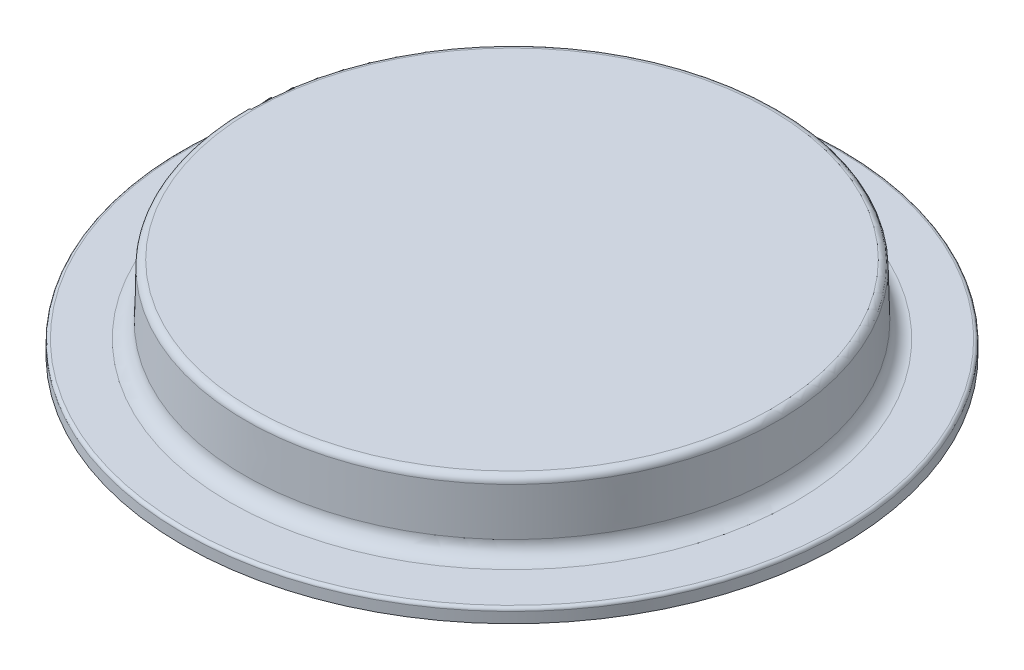
ISO-10303-21;
HEADER;
FILE_DESCRIPTION(('STEP AP214'),'2;1');
FILE_NAME('part.step','',(''),(''),'','','');
FILE_SCHEMA(('AUTOMOTIVE_DESIGN { 1 0 10303 214 1 1 1 1 }'));
ENDSEC;
DATA;
#1=APPLICATION_CONTEXT('core data for automotive mechanical design processes');
#2=APPLICATION_PROTOCOL_DEFINITION('international standard','automotive_design',2000,#1);
#3=PRODUCT_CONTEXT('',#1,'mechanical');
#4=PRODUCT('Part','Part','',(#3));
#5=PRODUCT_RELATED_PRODUCT_CATEGORY('part','',(#4));
#6=PRODUCT_DEFINITION_FORMATION('','',#4);
#7=PRODUCT_DEFINITION_CONTEXT('part definition',#1,'design');
#8=PRODUCT_DEFINITION('design','',#6,#7);
#9=PRODUCT_DEFINITION_SHAPE('','',#8);
#10=(LENGTH_UNIT() NAMED_UNIT(*) SI_UNIT(.MILLI.,.METRE.));
#11=(NAMED_UNIT(*) PLANE_ANGLE_UNIT() SI_UNIT($,.RADIAN.));
#12=(NAMED_UNIT(*) SI_UNIT($,.STERADIAN.) SOLID_ANGLE_UNIT());
#13=UNCERTAINTY_MEASURE_WITH_UNIT(LENGTH_MEASURE(1.E-05),#10,'distance_accuracy_value','');
#14=(GEOMETRIC_REPRESENTATION_CONTEXT(3) GLOBAL_UNCERTAINTY_ASSIGNED_CONTEXT((#13)) GLOBAL_UNIT_ASSIGNED_CONTEXT((#10,
#11,#12)) REPRESENTATION_CONTEXT('',''));
#15=CARTESIAN_POINT('',(0.,0.,0.));
#16=DIRECTION('',(0.,0.,1.));
#17=DIRECTION('',(1.,0.,0.));
#18=AXIS2_PLACEMENT_3D('',#15,#16,#17);
#19=CARTESIAN_POINT('',(0.,-0.793750000000001,6.35));
#20=DIRECTION('',(0.,1.,0.));
#21=DIRECTION('',(0.,0.,1.));
#22=AXIS2_PLACEMENT_3D('',#19,#20,#21);
#23=PLANE('',#22);
#24=CARTESIAN_POINT('',(0.,-0.793749999999999,0.));
#25=DIRECTION('',(0.,-1.,0.));
#26=DIRECTION('',(0.,0.,-1.));
#27=AXIS2_PLACEMENT_3D('',#24,#25,#26);
#28=CIRCLE('',#27,6.35);
#29=CARTESIAN_POINT('',(0.,-0.793749999999998,-6.35));
#30=VERTEX_POINT('',#29);
#31=EDGE_CURVE('E73',#30,#30,#28,.T.);
#32=ORIENTED_EDGE('',*,*,#31,.T.);
#33=EDGE_LOOP('',(#32));
#34=FACE_BOUND('',#33,.T.);
#35=ADVANCED_FACE('F47',(#34),#23,.F.);
#36=CARTESIAN_POINT('',(0.,0.793749999999999,4.9911));
#37=DIRECTION('',(0.,-1.,0.));
#38=DIRECTION('',(0.,0.,-1.));
#39=AXIS2_PLACEMENT_3D('',#36,#37,#38);
#40=PLANE('',#39);
#41=CARTESIAN_POINT('',(0.,0.79375,0.));
#42=DIRECTION('',(0.,-1.,0.));
#43=DIRECTION('',(0.,0.,-1.));
#44=AXIS2_PLACEMENT_3D('',#41,#42,#43);
#45=CIRCLE('',#44,4.9911);
#46=CARTESIAN_POINT('',(0.,0.793750000000001,-4.9911));
#47=VERTEX_POINT('',#46);
#48=EDGE_CURVE('E67',#47,#47,#45,.T.);
#49=ORIENTED_EDGE('',*,*,#48,.F.);
#50=EDGE_LOOP('',(#49));
#51=FACE_BOUND('',#50,.T.);
#52=ADVANCED_FACE('F91',(#51),#40,.F.);
#53=CARTESIAN_POINT('',(0.,0.660400000000001,0.));
#54=DIRECTION('',(0.,-1.,0.));
#55=DIRECTION('',(0.,0.,-1.));
#56=AXIS2_PLACEMENT_3D('',#53,#54,#55);
#57=TOROIDAL_SURFACE('',#56,4.9911,0.133349999999999);
#58=CARTESIAN_POINT('',(0.,0.663890696056855,0.));
#59=DIRECTION('',(0.,-1.,0.));
#60=DIRECTION('',(0.,0.,-1.));
#61=AXIS2_PLACEMENT_3D('',#58,#59,#60);
#62=CIRCLE('',#61,5.12440430428549);
#63=CARTESIAN_POINT('',(0.,0.663890696056856,-5.12440430428549));
#64=VERTEX_POINT('',#63);
#65=EDGE_CURVE('E70',#64,#64,#62,.T.);
#66=ORIENTED_EDGE('',*,*,#65,.F.);
#67=EDGE_LOOP('',(#66));
#68=FACE_BOUND('',#67,.T.);
#69=ORIENTED_EDGE('',*,*,#48,.T.);
#70=EDGE_LOOP('',(#69));
#71=FACE_BOUND('',#70,.T.);
#72=ADVANCED_FACE('F96',(#68,#71),#57,.T.);
#73=CARTESIAN_POINT('',(0.,0.663890696056855,0.));
#74=DIRECTION('',(0.,-1.,0.));
#75=DIRECTION('',(0.,0.,-1.));
#76=AXIS2_PLACEMENT_3D('',#73,#74,#75);
#77=CONICAL_SURFACE('',#76,5.12440430428549,0.0261799387799085);
#78=CARTESIAN_POINT('',(0.,-0.238394207646745,0.));
#79=DIRECTION('',(0.,-1.,0.));
#80=DIRECTION('',(0.,0.,-1.));
#81=AXIS2_PLACEMENT_3D('',#78,#79,#80);
#82=CIRCLE('',#81,5.14803146600693);
#83=CARTESIAN_POINT('',(0.,-0.238394207646744,-5.14803146600693));
#84=VERTEX_POINT('',#83);
#85=EDGE_CURVE('E58',#84,#84,#82,.F.);
#86=ORIENTED_EDGE('',*,*,#85,.T.);
#87=EDGE_LOOP('',(#86));
#88=FACE_BOUND('',#87,.T.);
#89=ORIENTED_EDGE('',*,*,#65,.T.);
#90=EDGE_LOOP('',(#89));
#91=FACE_BOUND('',#90,.T.);
#92=ADVANCED_FACE('F88',(#88,#91),#77,.T.);
#93=CARTESIAN_POINT('',(0.,-0.529166666666667,6.35));
#94=DIRECTION('',(0.,-1.,0.));
#95=DIRECTION('',(0.,0.,-1.));
#96=AXIS2_PLACEMENT_3D('',#93,#94,#95);
#97=PLANE('',#96);
#98=CARTESIAN_POINT('',(0.,-0.529166666666666,0.));
#99=DIRECTION('',(0.,-1.,0.));
#100=DIRECTION('',(0.,0.,-1.));
#101=AXIS2_PLACEMENT_3D('',#98,#99,#100);
#102=CIRCLE('',#101,6.29028228054066);
#103=CARTESIAN_POINT('',(0.,-0.529166666666665,-6.29028228054066));
#104=VERTEX_POINT('',#103);
#105=EDGE_CURVE('E12',#104,#104,#102,.F.);
#106=ORIENTED_EDGE('',*,*,#105,.T.);
#107=EDGE_LOOP('',(#106));
#108=FACE_BOUND('',#107,.T.);
#109=CARTESIAN_POINT('',(0.,-0.529166666666666,0.));
#110=DIRECTION('',(0.,-1.,0.));
#111=DIRECTION('',(0.,0.,-1.));
#112=AXIS2_PLACEMENT_3D('',#109,#110,#111);
#113=CIRCLE('',#112,5.44651774444872);
#114=CARTESIAN_POINT('',(0.,-0.529166666666665,-5.44651774444872));
#115=VERTEX_POINT('',#114);
#116=EDGE_CURVE('E62',#115,#115,#113,.T.);
#117=ORIENTED_EDGE('',*,*,#116,.T.);
#118=EDGE_LOOP('',(#117));
#119=FACE_BOUND('',#118,.T.);
#120=ADVANCED_FACE('F81',(#108,#119),#97,.F.);
#121=CARTESIAN_POINT('',(0.,-0.79375,0.));
#122=DIRECTION('',(0.,-1.,0.));
#123=DIRECTION('',(0.,0.,-1.));
#124=AXIS2_PLACEMENT_3D('',#121,#122,#123);
#125=CYLINDRICAL_SURFACE('',#124,6.35);
#126=CARTESIAN_POINT('',(0.,-0.588884386126001,0.));
#127=DIRECTION('',(0.,-1.,0.));
#128=DIRECTION('',(0.,0.,-1.));
#129=AXIS2_PLACEMENT_3D('',#126,#127,#128);
#130=CIRCLE('',#129,6.35);
#131=CARTESIAN_POINT('',(0.,-0.588884386125999,-6.35));
#132=VERTEX_POINT('',#131);
#133=EDGE_CURVE('E54',#132,#132,#130,.T.);
#134=ORIENTED_EDGE('',*,*,#133,.T.);
#135=EDGE_LOOP('',(#134));
#136=FACE_BOUND('',#135,.T.);
#137=ORIENTED_EDGE('',*,*,#31,.F.);
#138=EDGE_LOOP('',(#137));
#139=FACE_BOUND('',#138,.T.);
#140=ADVANCED_FACE('F78',(#136,#139),#125,.T.);
#141=CARTESIAN_POINT('',(0.,-0.230578069369991,0.));
#142=DIRECTION('',(0.,-1.,0.));
#143=DIRECTION('',(0.,0.,-1.));
#144=AXIS2_PLACEMENT_3D('',#141,#142,#143);
#145=TOROIDAL_SURFACE('',#144,5.44651774444872,0.298588597296675);
#146=ORIENTED_EDGE('',*,*,#85,.F.);
#147=EDGE_LOOP('',(#146));
#148=FACE_BOUND('',#147,.T.);
#149=ORIENTED_EDGE('',*,*,#116,.F.);
#150=EDGE_LOOP('',(#149));
#151=FACE_BOUND('',#150,.T.);
#152=ADVANCED_FACE('F80',(#148,#151),#145,.F.);
#153=CARTESIAN_POINT('',(0.,-0.588884386126001,0.));
#154=DIRECTION('',(0.,-1.,0.));
#155=DIRECTION('',(0.,0.,-1.));
#156=AXIS2_PLACEMENT_3D('',#153,#154,#155);
#157=TOROIDAL_SURFACE('',#156,6.29028228054066,0.0597177194593349);
#158=ORIENTED_EDGE('',*,*,#105,.F.);
#159=EDGE_LOOP('',(#158));
#160=FACE_BOUND('',#159,.T.);
#161=ORIENTED_EDGE('',*,*,#133,.F.);
#162=EDGE_LOOP('',(#161));
#163=FACE_BOUND('',#162,.T.);
#164=ADVANCED_FACE('F49',(#160,#163),#157,.T.);
#165=CLOSED_SHELL('',(#35,#52,#72,#92,#120,#140,#152,#164));
#166=MANIFOLD_SOLID_BREP('B2',#165);
#167=ADVANCED_BREP_SHAPE_REPRESENTATION('',(#18,#166),#14);
#168=SHAPE_DEFINITION_REPRESENTATION(#9,#167);
ENDSEC;
END-ISO-10303-21;
